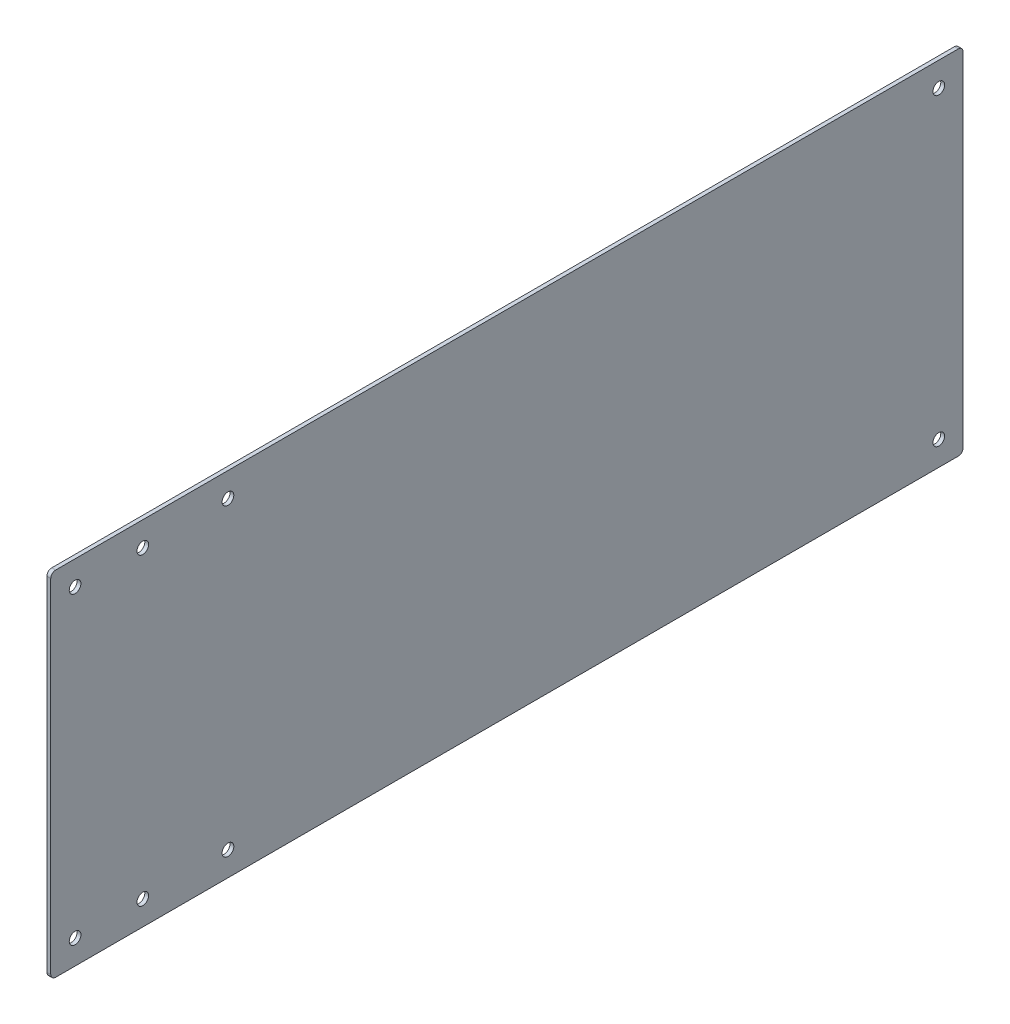
ISO-10303-21;
HEADER;
FILE_DESCRIPTION(('STEP AP214'),'2;1');
FILE_NAME('part.step','',(''),(''),'','','');
FILE_SCHEMA(('AUTOMOTIVE_DESIGN { 1 0 10303 214 1 1 1 1 }'));
ENDSEC;
DATA;
#1=APPLICATION_CONTEXT('core data for automotive mechanical design processes');
#2=APPLICATION_PROTOCOL_DEFINITION('international standard','automotive_design',2000,#1);
#3=PRODUCT_CONTEXT('',#1,'mechanical');
#4=PRODUCT('Part','Part','',(#3));
#5=PRODUCT_RELATED_PRODUCT_CATEGORY('part','',(#4));
#6=PRODUCT_DEFINITION_FORMATION('','',#4);
#7=PRODUCT_DEFINITION_CONTEXT('part definition',#1,'design');
#8=PRODUCT_DEFINITION('design','',#6,#7);
#9=PRODUCT_DEFINITION_SHAPE('','',#8);
#10=(LENGTH_UNIT() NAMED_UNIT(*) SI_UNIT(.MILLI.,.METRE.));
#11=(NAMED_UNIT(*) PLANE_ANGLE_UNIT() SI_UNIT($,.RADIAN.));
#12=(NAMED_UNIT(*) SI_UNIT($,.STERADIAN.) SOLID_ANGLE_UNIT());
#13=UNCERTAINTY_MEASURE_WITH_UNIT(LENGTH_MEASURE(1.E-05),#10,'distance_accuracy_value','');
#14=(GEOMETRIC_REPRESENTATION_CONTEXT(3) GLOBAL_UNCERTAINTY_ASSIGNED_CONTEXT((#13)) GLOBAL_UNIT_ASSIGNED_CONTEXT((#10,
#11,#12)) REPRESENTATION_CONTEXT('',''));
#15=CARTESIAN_POINT('',(0.,0.,0.));
#16=DIRECTION('',(0.,0.,1.));
#17=DIRECTION('',(1.,0.,0.));
#18=AXIS2_PLACEMENT_3D('',#15,#16,#17);
#19=CARTESIAN_POINT('',(-1.5875,-72.49,-187.5));
#20=DIRECTION('',(0.,0.,-1.));
#21=DIRECTION('',(-1.,0.,0.));
#22=AXIS2_PLACEMENT_3D('',#19,#20,#21);
#23=PLANE('',#22);
#24=DIRECTION('',(0.,1.,0.));
#25=VECTOR('',#24,1.);
#26=CARTESIAN_POINT('',(0.,-72.49,-187.5));
#27=LINE('',#26,#25);
#28=CARTESIAN_POINT('',(0.,-70.49,-187.5));
#29=VERTEX_POINT('',#28);
#30=CARTESIAN_POINT('',(0.,70.49,-187.5));
#31=VERTEX_POINT('',#30);
#32=EDGE_CURVE('E113',#29,#31,#27,.T.);
#33=ORIENTED_EDGE('',*,*,#32,.F.);
#34=DIRECTION('',(1.,0.,0.));
#35=VECTOR('',#34,1.);
#36=CARTESIAN_POINT('',(-1.5875,-70.49,-187.5));
#37=LINE('',#36,#35);
#38=CARTESIAN_POINT('',(-1.5875,-70.49,-187.5));
#39=VERTEX_POINT('',#38);
#40=EDGE_CURVE('E48',#29,#39,#37,.F.);
#41=ORIENTED_EDGE('',*,*,#40,.T.);
#42=DIRECTION('',(0.,1.,0.));
#43=VECTOR('',#42,1.);
#44=CARTESIAN_POINT('',(-1.5875,-72.49,-187.5));
#45=LINE('',#44,#43);
#46=CARTESIAN_POINT('',(-1.5875,70.49,-187.5));
#47=VERTEX_POINT('',#46);
#48=EDGE_CURVE('E170',#39,#47,#45,.T.);
#49=ORIENTED_EDGE('',*,*,#48,.T.);
#50=DIRECTION('',(1.,0.,0.));
#51=VECTOR('',#50,1.);
#52=CARTESIAN_POINT('',(-1.5875,70.49,-187.5));
#53=LINE('',#52,#51);
#54=EDGE_CURVE('E149',#47,#31,#53,.T.);
#55=ORIENTED_EDGE('',*,*,#54,.T.);
#56=EDGE_LOOP('',(#33,#41,#49,#55));
#57=FACE_BOUND('',#56,.T.);
#58=ADVANCED_FACE('F40',(#57),#23,.T.);
#59=CARTESIAN_POINT('',(-1.5875,-72.49,187.5));
#60=DIRECTION('',(0.,-1.,0.));
#61=DIRECTION('',(0.,0.,-1.));
#62=AXIS2_PLACEMENT_3D('',#59,#60,#61);
#63=PLANE('',#62);
#64=DIRECTION('',(0.,0.,-1.));
#65=VECTOR('',#64,1.);
#66=CARTESIAN_POINT('',(-1.5875,-72.49,187.5));
#67=LINE('',#66,#65);
#68=CARTESIAN_POINT('',(-1.5875,-72.49,185.5));
#69=VERTEX_POINT('',#68);
#70=CARTESIAN_POINT('',(-1.5875,-72.49,-185.5));
#71=VERTEX_POINT('',#70);
#72=EDGE_CURVE('E127',#69,#71,#67,.T.);
#73=ORIENTED_EDGE('',*,*,#72,.T.);
#74=DIRECTION('',(1.,0.,0.));
#75=VECTOR('',#74,1.);
#76=CARTESIAN_POINT('',(-1.5875,-72.49,-185.5));
#77=LINE('',#76,#75);
#78=CARTESIAN_POINT('',(0.,-72.49,-185.5));
#79=VERTEX_POINT('',#78);
#80=EDGE_CURVE('E158',#71,#79,#77,.T.);
#81=ORIENTED_EDGE('',*,*,#80,.T.);
#82=DIRECTION('',(0.,0.,-1.));
#83=VECTOR('',#82,1.);
#84=CARTESIAN_POINT('',(0.,-72.49,187.5));
#85=LINE('',#84,#83);
#86=CARTESIAN_POINT('',(0.,-72.49,185.5));
#87=VERTEX_POINT('',#86);
#88=EDGE_CURVE('E134',#87,#79,#85,.T.);
#89=ORIENTED_EDGE('',*,*,#88,.F.);
#90=DIRECTION('',(1.,0.,0.));
#91=VECTOR('',#90,1.);
#92=CARTESIAN_POINT('',(-1.5875,-72.49,185.5));
#93=LINE('',#92,#91);
#94=EDGE_CURVE('E145',#87,#69,#93,.F.);
#95=ORIENTED_EDGE('',*,*,#94,.T.);
#96=EDGE_LOOP('',(#73,#81,#89,#95));
#97=FACE_BOUND('',#96,.T.);
#98=ADVANCED_FACE('F164',(#97),#63,.T.);
#99=CARTESIAN_POINT('',(-1.5875,-72.49,187.5));
#100=DIRECTION('',(0.,0.,1.));
#101=DIRECTION('',(1.,0.,0.));
#102=AXIS2_PLACEMENT_3D('',#99,#100,#101);
#103=PLANE('',#102);
#104=DIRECTION('',(0.,-1.,0.));
#105=VECTOR('',#104,1.);
#106=CARTESIAN_POINT('',(-1.5875,-72.49,187.5));
#107=LINE('',#106,#105);
#108=CARTESIAN_POINT('',(-1.5875,70.49,187.5));
#109=VERTEX_POINT('',#108);
#110=CARTESIAN_POINT('',(-1.5875,-70.49,187.5));
#111=VERTEX_POINT('',#110);
#112=EDGE_CURVE('E131',#109,#111,#107,.T.);
#113=ORIENTED_EDGE('',*,*,#112,.T.);
#114=DIRECTION('',(1.,0.,0.));
#115=VECTOR('',#114,1.);
#116=CARTESIAN_POINT('',(-1.5875,-70.49,187.5));
#117=LINE('',#116,#115);
#118=CARTESIAN_POINT('',(0.,-70.49,187.5));
#119=VERTEX_POINT('',#118);
#120=EDGE_CURVE('E140',#111,#119,#117,.T.);
#121=ORIENTED_EDGE('',*,*,#120,.T.);
#122=DIRECTION('',(0.,-1.,0.));
#123=VECTOR('',#122,1.);
#124=CARTESIAN_POINT('',(0.,-72.49,187.5));
#125=LINE('',#124,#123);
#126=CARTESIAN_POINT('',(0.,70.49,187.5));
#127=VERTEX_POINT('',#126);
#128=EDGE_CURVE('E112',#127,#119,#125,.T.);
#129=ORIENTED_EDGE('',*,*,#128,.F.);
#130=DIRECTION('',(1.,0.,0.));
#131=VECTOR('',#130,1.);
#132=CARTESIAN_POINT('',(-1.5875,70.49,187.5));
#133=LINE('',#132,#131);
#134=EDGE_CURVE('E121',#127,#109,#133,.F.);
#135=ORIENTED_EDGE('',*,*,#134,.T.);
#136=EDGE_LOOP('',(#113,#121,#129,#135));
#137=FACE_BOUND('',#136,.T.);
#138=ADVANCED_FACE('F271',(#137),#103,.T.);
#139=CARTESIAN_POINT('',(-1.5875,72.49,187.5));
#140=DIRECTION('',(0.,1.,0.));
#141=DIRECTION('',(0.,0.,1.));
#142=AXIS2_PLACEMENT_3D('',#139,#140,#141);
#143=PLANE('',#142);
#144=DIRECTION('',(0.,0.,1.));
#145=VECTOR('',#144,1.);
#146=CARTESIAN_POINT('',(0.,72.49,187.5));
#147=LINE('',#146,#145);
#148=CARTESIAN_POINT('',(0.,72.49,-185.5));
#149=VERTEX_POINT('',#148);
#150=CARTESIAN_POINT('',(0.,72.49,185.5));
#151=VERTEX_POINT('',#150);
#152=EDGE_CURVE('E101',#149,#151,#147,.T.);
#153=ORIENTED_EDGE('',*,*,#152,.F.);
#154=DIRECTION('',(1.,0.,0.));
#155=VECTOR('',#154,1.);
#156=CARTESIAN_POINT('',(-1.5875,72.49,-185.5));
#157=LINE('',#156,#155);
#158=CARTESIAN_POINT('',(-1.5875,72.49,-185.5));
#159=VERTEX_POINT('',#158);
#160=EDGE_CURVE('E153',#149,#159,#157,.F.);
#161=ORIENTED_EDGE('',*,*,#160,.T.);
#162=DIRECTION('',(0.,0.,1.));
#163=VECTOR('',#162,1.);
#164=CARTESIAN_POINT('',(-1.5875,72.49,187.5));
#165=LINE('',#164,#163);
#166=CARTESIAN_POINT('',(-1.5875,72.49,185.5));
#167=VERTEX_POINT('',#166);
#168=EDGE_CURVE('E125',#159,#167,#165,.T.);
#169=ORIENTED_EDGE('',*,*,#168,.T.);
#170=DIRECTION('',(1.,0.,0.));
#171=VECTOR('',#170,1.);
#172=CARTESIAN_POINT('',(-1.5875,72.49,185.5));
#173=LINE('',#172,#171);
#174=EDGE_CURVE('E120',#167,#151,#173,.T.);
#175=ORIENTED_EDGE('',*,*,#174,.T.);
#176=EDGE_LOOP('',(#153,#161,#169,#175));
#177=FACE_BOUND('',#176,.T.);
#178=ADVANCED_FACE('F123',(#177),#143,.T.);
#179=CARTESIAN_POINT('',(-1.5875,0.,0.));
#180=DIRECTION('',(-1.,0.,0.));
#181=DIRECTION('',(0.,0.,1.));
#182=AXIS2_PLACEMENT_3D('',#179,#180,#181);
#183=PLANE('',#182);
#184=CARTESIAN_POINT('',(-1.5875,-62.49,149.66));
#185=DIRECTION('',(1.,0.,0.));
#186=DIRECTION('',(0.,0.,-1.));
#187=AXIS2_PLACEMENT_3D('',#184,#185,#186);
#188=CIRCLE('',#187,2.4);
#189=CARTESIAN_POINT('',(-1.5875,-62.49,147.26));
#190=VERTEX_POINT('',#189);
#191=EDGE_CURVE('E219',#190,#190,#188,.T.);
#192=ORIENTED_EDGE('',*,*,#191,.T.);
#193=EDGE_LOOP('',(#192));
#194=FACE_BOUND('',#193,.T.);
#195=CARTESIAN_POINT('',(-1.5875,-62.49,114.66));
#196=DIRECTION('',(1.,0.,0.));
#197=DIRECTION('',(0.,0.,-1.));
#198=AXIS2_PLACEMENT_3D('',#195,#196,#197);
#199=CIRCLE('',#198,2.4);
#200=CARTESIAN_POINT('',(-1.5875,-62.49,112.26));
#201=VERTEX_POINT('',#200);
#202=EDGE_CURVE('E213',#201,#201,#199,.T.);
#203=ORIENTED_EDGE('',*,*,#202,.T.);
#204=EDGE_LOOP('',(#203));
#205=FACE_BOUND('',#204,.T.);
#206=CARTESIAN_POINT('',(-1.5875,62.49,149.66));
#207=DIRECTION('',(1.,0.,0.));
#208=DIRECTION('',(0.,0.,-1.));
#209=AXIS2_PLACEMENT_3D('',#206,#207,#208);
#210=CIRCLE('',#209,2.40000000000001);
#211=CARTESIAN_POINT('',(-1.5875,62.49,147.26));
#212=VERTEX_POINT('',#211);
#213=EDGE_CURVE('E207',#212,#212,#210,.T.);
#214=ORIENTED_EDGE('',*,*,#213,.T.);
#215=EDGE_LOOP('',(#214));
#216=FACE_BOUND('',#215,.T.);
#217=CARTESIAN_POINT('',(-1.5875,62.49,114.66));
#218=DIRECTION('',(1.,0.,0.));
#219=DIRECTION('',(0.,0.,-1.));
#220=AXIS2_PLACEMENT_3D('',#217,#218,#219);
#221=CIRCLE('',#220,2.40000000000001);
#222=CARTESIAN_POINT('',(-1.5875,62.49,112.26));
#223=VERTEX_POINT('',#222);
#224=EDGE_CURVE('E201',#223,#223,#221,.T.);
#225=ORIENTED_EDGE('',*,*,#224,.T.);
#226=EDGE_LOOP('',(#225));
#227=FACE_BOUND('',#226,.T.);
#228=CARTESIAN_POINT('',(-1.5875,-62.49,177.5));
#229=DIRECTION('',(-1.,0.,0.));
#230=DIRECTION('',(0.,0.,1.));
#231=AXIS2_PLACEMENT_3D('',#228,#229,#230);
#232=CIRCLE('',#231,2.4);
#233=CARTESIAN_POINT('',(-1.5875,-62.49,179.9));
#234=VERTEX_POINT('',#233);
#235=EDGE_CURVE('E198',#234,#234,#232,.T.);
#236=ORIENTED_EDGE('',*,*,#235,.F.);
#237=EDGE_LOOP('',(#236));
#238=FACE_BOUND('',#237,.T.);
#239=CARTESIAN_POINT('',(-1.5875,-62.49,-177.5));
#240=DIRECTION('',(-1.,0.,0.));
#241=DIRECTION('',(0.,0.,1.));
#242=AXIS2_PLACEMENT_3D('',#239,#240,#241);
#243=CIRCLE('',#242,2.4);
#244=CARTESIAN_POINT('',(-1.5875,-62.49,-175.1));
#245=VERTEX_POINT('',#244);
#246=EDGE_CURVE('E192',#245,#245,#243,.T.);
#247=ORIENTED_EDGE('',*,*,#246,.F.);
#248=EDGE_LOOP('',(#247));
#249=FACE_BOUND('',#248,.T.);
#250=CARTESIAN_POINT('',(-1.5875,62.49,-177.5));
#251=DIRECTION('',(-1.,0.,0.));
#252=DIRECTION('',(0.,0.,1.));
#253=AXIS2_PLACEMENT_3D('',#250,#251,#252);
#254=CIRCLE('',#253,2.40000000000001);
#255=CARTESIAN_POINT('',(-1.5875,62.49,-175.1));
#256=VERTEX_POINT('',#255);
#257=EDGE_CURVE('E186',#256,#256,#254,.T.);
#258=ORIENTED_EDGE('',*,*,#257,.F.);
#259=EDGE_LOOP('',(#258));
#260=FACE_BOUND('',#259,.T.);
#261=CARTESIAN_POINT('',(-1.5875,62.49,177.5));
#262=DIRECTION('',(-1.,0.,0.));
#263=DIRECTION('',(0.,0.,1.));
#264=AXIS2_PLACEMENT_3D('',#261,#262,#263);
#265=CIRCLE('',#264,2.40000000000001);
#266=CARTESIAN_POINT('',(-1.5875,62.49,179.9));
#267=VERTEX_POINT('',#266);
#268=EDGE_CURVE('E180',#267,#267,#265,.T.);
#269=ORIENTED_EDGE('',*,*,#268,.F.);
#270=EDGE_LOOP('',(#269));
#271=FACE_BOUND('',#270,.T.);
#272=ORIENTED_EDGE('',*,*,#48,.F.);
#273=CARTESIAN_POINT('',(-1.5875,-70.49,-185.5));
#274=DIRECTION('',(-1.,0.,0.));
#275=DIRECTION('',(0.,0.,1.));
#276=AXIS2_PLACEMENT_3D('',#273,#274,#275);
#277=CIRCLE('',#276,2.);
#278=EDGE_CURVE('E11',#39,#71,#277,.T.);
#279=ORIENTED_EDGE('',*,*,#278,.T.);
#280=ORIENTED_EDGE('',*,*,#72,.F.);
#281=CARTESIAN_POINT('',(-1.5875,-70.49,185.5));
#282=DIRECTION('',(-1.,0.,0.));
#283=DIRECTION('',(0.,0.,1.));
#284=AXIS2_PLACEMENT_3D('',#281,#282,#283);
#285=CIRCLE('',#284,2.);
#286=EDGE_CURVE('E147',#69,#111,#285,.T.);
#287=ORIENTED_EDGE('',*,*,#286,.T.);
#288=ORIENTED_EDGE('',*,*,#112,.F.);
#289=CARTESIAN_POINT('',(-1.5875,70.49,185.5));
#290=DIRECTION('',(-1.,0.,0.));
#291=DIRECTION('',(0.,0.,1.));
#292=AXIS2_PLACEMENT_3D('',#289,#290,#291);
#293=CIRCLE('',#292,2.);
#294=EDGE_CURVE('E138',#109,#167,#293,.T.);
#295=ORIENTED_EDGE('',*,*,#294,.T.);
#296=ORIENTED_EDGE('',*,*,#168,.F.);
#297=CARTESIAN_POINT('',(-1.5875,70.49,-185.5));
#298=DIRECTION('',(-1.,0.,0.));
#299=DIRECTION('',(0.,0.,1.));
#300=AXIS2_PLACEMENT_3D('',#297,#298,#299);
#301=CIRCLE('',#300,2.);
#302=EDGE_CURVE('E155',#159,#47,#301,.T.);
#303=ORIENTED_EDGE('',*,*,#302,.T.);
#304=EDGE_LOOP('',(#272,#279,#280,#287,#288,#295,#296,#303));
#305=FACE_BOUND('',#304,.T.);
#306=ADVANCED_FACE('F231',(#194,#205,#216,#227,#238,#249,#260,#271,#305),#183,.T.);
#307=CARTESIAN_POINT('',(0.,0.,0.));
#308=DIRECTION('',(-1.,0.,0.));
#309=DIRECTION('',(0.,0.,1.));
#310=AXIS2_PLACEMENT_3D('',#307,#308,#309);
#311=PLANE('',#310);
#312=CARTESIAN_POINT('',(0.,-62.49,149.66));
#313=DIRECTION('',(1.,0.,0.));
#314=DIRECTION('',(0.,0.,-1.));
#315=AXIS2_PLACEMENT_3D('',#312,#313,#314);
#316=CIRCLE('',#315,2.4);
#317=CARTESIAN_POINT('',(0.,-62.49,147.26));
#318=VERTEX_POINT('',#317);
#319=EDGE_CURVE('E222',#318,#318,#316,.T.);
#320=ORIENTED_EDGE('',*,*,#319,.F.);
#321=EDGE_LOOP('',(#320));
#322=FACE_BOUND('',#321,.T.);
#323=CARTESIAN_POINT('',(0.,-62.49,114.66));
#324=DIRECTION('',(1.,0.,0.));
#325=DIRECTION('',(0.,0.,-1.));
#326=AXIS2_PLACEMENT_3D('',#323,#324,#325);
#327=CIRCLE('',#326,2.4);
#328=CARTESIAN_POINT('',(0.,-62.49,112.26));
#329=VERTEX_POINT('',#328);
#330=EDGE_CURVE('E216',#329,#329,#327,.T.);
#331=ORIENTED_EDGE('',*,*,#330,.F.);
#332=EDGE_LOOP('',(#331));
#333=FACE_BOUND('',#332,.T.);
#334=CARTESIAN_POINT('',(0.,62.49,149.66));
#335=DIRECTION('',(1.,0.,0.));
#336=DIRECTION('',(0.,0.,-1.));
#337=AXIS2_PLACEMENT_3D('',#334,#335,#336);
#338=CIRCLE('',#337,2.40000000000001);
#339=CARTESIAN_POINT('',(0.,62.49,147.26));
#340=VERTEX_POINT('',#339);
#341=EDGE_CURVE('E210',#340,#340,#338,.T.);
#342=ORIENTED_EDGE('',*,*,#341,.F.);
#343=EDGE_LOOP('',(#342));
#344=FACE_BOUND('',#343,.T.);
#345=CARTESIAN_POINT('',(0.,62.49,114.66));
#346=DIRECTION('',(1.,0.,0.));
#347=DIRECTION('',(0.,0.,-1.));
#348=AXIS2_PLACEMENT_3D('',#345,#346,#347);
#349=CIRCLE('',#348,2.40000000000001);
#350=CARTESIAN_POINT('',(0.,62.49,112.26));
#351=VERTEX_POINT('',#350);
#352=EDGE_CURVE('E204',#351,#351,#349,.T.);
#353=ORIENTED_EDGE('',*,*,#352,.F.);
#354=EDGE_LOOP('',(#353));
#355=FACE_BOUND('',#354,.T.);
#356=CARTESIAN_POINT('',(0.,-62.49,177.5));
#357=DIRECTION('',(-1.,0.,0.));
#358=DIRECTION('',(0.,0.,1.));
#359=AXIS2_PLACEMENT_3D('',#356,#357,#358);
#360=CIRCLE('',#359,2.4);
#361=CARTESIAN_POINT('',(0.,-62.49,179.9));
#362=VERTEX_POINT('',#361);
#363=EDGE_CURVE('E195',#362,#362,#360,.T.);
#364=ORIENTED_EDGE('',*,*,#363,.T.);
#365=EDGE_LOOP('',(#364));
#366=FACE_BOUND('',#365,.T.);
#367=CARTESIAN_POINT('',(0.,-62.49,-177.5));
#368=DIRECTION('',(-1.,0.,0.));
#369=DIRECTION('',(0.,0.,1.));
#370=AXIS2_PLACEMENT_3D('',#367,#368,#369);
#371=CIRCLE('',#370,2.4);
#372=CARTESIAN_POINT('',(0.,-62.49,-175.1));
#373=VERTEX_POINT('',#372);
#374=EDGE_CURVE('E189',#373,#373,#371,.T.);
#375=ORIENTED_EDGE('',*,*,#374,.T.);
#376=EDGE_LOOP('',(#375));
#377=FACE_BOUND('',#376,.T.);
#378=CARTESIAN_POINT('',(0.,62.49,-177.5));
#379=DIRECTION('',(-1.,0.,0.));
#380=DIRECTION('',(0.,0.,1.));
#381=AXIS2_PLACEMENT_3D('',#378,#379,#380);
#382=CIRCLE('',#381,2.40000000000001);
#383=CARTESIAN_POINT('',(0.,62.49,-175.1));
#384=VERTEX_POINT('',#383);
#385=EDGE_CURVE('E183',#384,#384,#382,.T.);
#386=ORIENTED_EDGE('',*,*,#385,.T.);
#387=EDGE_LOOP('',(#386));
#388=FACE_BOUND('',#387,.T.);
#389=CARTESIAN_POINT('',(0.,62.49,177.5));
#390=DIRECTION('',(-1.,0.,0.));
#391=DIRECTION('',(0.,0.,1.));
#392=AXIS2_PLACEMENT_3D('',#389,#390,#391);
#393=CIRCLE('',#392,2.40000000000001);
#394=CARTESIAN_POINT('',(0.,62.49,179.9));
#395=VERTEX_POINT('',#394);
#396=EDGE_CURVE('E173',#395,#395,#393,.T.);
#397=ORIENTED_EDGE('',*,*,#396,.T.);
#398=EDGE_LOOP('',(#397));
#399=FACE_BOUND('',#398,.T.);
#400=ORIENTED_EDGE('',*,*,#88,.T.);
#401=CARTESIAN_POINT('',(0.,-70.49,-185.5));
#402=DIRECTION('',(-1.,0.,0.));
#403=DIRECTION('',(0.,0.,1.));
#404=AXIS2_PLACEMENT_3D('',#401,#402,#403);
#405=CIRCLE('',#404,2.);
#406=EDGE_CURVE('E62',#79,#29,#405,.F.);
#407=ORIENTED_EDGE('',*,*,#406,.T.);
#408=ORIENTED_EDGE('',*,*,#32,.T.);
#409=CARTESIAN_POINT('',(0.,70.49,-185.5));
#410=DIRECTION('',(-1.,0.,0.));
#411=DIRECTION('',(0.,0.,1.));
#412=AXIS2_PLACEMENT_3D('',#409,#410,#411);
#413=CIRCLE('',#412,2.);
#414=EDGE_CURVE('E108',#31,#149,#413,.F.);
#415=ORIENTED_EDGE('',*,*,#414,.T.);
#416=ORIENTED_EDGE('',*,*,#152,.T.);
#417=CARTESIAN_POINT('',(0.,70.49,185.5));
#418=DIRECTION('',(-1.,0.,0.));
#419=DIRECTION('',(0.,0.,1.));
#420=AXIS2_PLACEMENT_3D('',#417,#418,#419);
#421=CIRCLE('',#420,2.);
#422=EDGE_CURVE('E105',#151,#127,#421,.F.);
#423=ORIENTED_EDGE('',*,*,#422,.T.);
#424=ORIENTED_EDGE('',*,*,#128,.T.);
#425=CARTESIAN_POINT('',(0.,-70.49,185.5));
#426=DIRECTION('',(-1.,0.,0.));
#427=DIRECTION('',(0.,0.,1.));
#428=AXIS2_PLACEMENT_3D('',#425,#426,#427);
#429=CIRCLE('',#428,2.);
#430=EDGE_CURVE('E143',#119,#87,#429,.F.);
#431=ORIENTED_EDGE('',*,*,#430,.T.);
#432=EDGE_LOOP('',(#400,#407,#408,#415,#416,#423,#424,#431));
#433=FACE_BOUND('',#432,.T.);
#434=ADVANCED_FACE('F103',(#322,#333,#344,#355,#366,#377,#388,#399,#433),#311,.F.);
#435=CARTESIAN_POINT('',(-1.5875,62.49,177.5));
#436=DIRECTION('',(-1.,0.,0.));
#437=DIRECTION('',(0.,0.,1.));
#438=AXIS2_PLACEMENT_3D('',#435,#436,#437);
#439=CYLINDRICAL_SURFACE('',#438,2.40000000000001);
#440=ORIENTED_EDGE('',*,*,#396,.F.);
#441=EDGE_LOOP('',(#440));
#442=FACE_BOUND('',#441,.T.);
#443=ORIENTED_EDGE('',*,*,#268,.T.);
#444=EDGE_LOOP('',(#443));
#445=FACE_BOUND('',#444,.T.);
#446=ADVANCED_FACE('F230',(#442,#445),#439,.F.);
#447=CARTESIAN_POINT('',(-1.5875,62.49,-177.5));
#448=DIRECTION('',(-1.,0.,0.));
#449=DIRECTION('',(0.,0.,1.));
#450=AXIS2_PLACEMENT_3D('',#447,#448,#449);
#451=CYLINDRICAL_SURFACE('',#450,2.40000000000001);
#452=ORIENTED_EDGE('',*,*,#385,.F.);
#453=EDGE_LOOP('',(#452));
#454=FACE_BOUND('',#453,.T.);
#455=ORIENTED_EDGE('',*,*,#257,.T.);
#456=EDGE_LOOP('',(#455));
#457=FACE_BOUND('',#456,.T.);
#458=ADVANCED_FACE('F249',(#454,#457),#451,.F.);
#459=CARTESIAN_POINT('',(-1.5875,-62.49,-177.5));
#460=DIRECTION('',(-1.,0.,0.));
#461=DIRECTION('',(0.,0.,1.));
#462=AXIS2_PLACEMENT_3D('',#459,#460,#461);
#463=CYLINDRICAL_SURFACE('',#462,2.4);
#464=ORIENTED_EDGE('',*,*,#374,.F.);
#465=EDGE_LOOP('',(#464));
#466=FACE_BOUND('',#465,.T.);
#467=ORIENTED_EDGE('',*,*,#246,.T.);
#468=EDGE_LOOP('',(#467));
#469=FACE_BOUND('',#468,.T.);
#470=ADVANCED_FACE('F293',(#466,#469),#463,.F.);
#471=CARTESIAN_POINT('',(-1.5875,-62.49,177.5));
#472=DIRECTION('',(-1.,0.,0.));
#473=DIRECTION('',(0.,0.,1.));
#474=AXIS2_PLACEMENT_3D('',#471,#472,#473);
#475=CYLINDRICAL_SURFACE('',#474,2.4);
#476=ORIENTED_EDGE('',*,*,#363,.F.);
#477=EDGE_LOOP('',(#476));
#478=FACE_BOUND('',#477,.T.);
#479=ORIENTED_EDGE('',*,*,#235,.T.);
#480=EDGE_LOOP('',(#479));
#481=FACE_BOUND('',#480,.T.);
#482=ADVANCED_FACE('F297',(#478,#481),#475,.F.);
#483=CARTESIAN_POINT('',(0.,62.49,114.66));
#484=DIRECTION('',(1.,0.,0.));
#485=DIRECTION('',(0.,0.,-1.));
#486=AXIS2_PLACEMENT_3D('',#483,#484,#485);
#487=CYLINDRICAL_SURFACE('',#486,2.40000000000001);
#488=ORIENTED_EDGE('',*,*,#224,.F.);
#489=EDGE_LOOP('',(#488));
#490=FACE_BOUND('',#489,.T.);
#491=ORIENTED_EDGE('',*,*,#352,.T.);
#492=EDGE_LOOP('',(#491));
#493=FACE_BOUND('',#492,.T.);
#494=ADVANCED_FACE('F301',(#490,#493),#487,.F.);
#495=CARTESIAN_POINT('',(0.,62.49,149.66));
#496=DIRECTION('',(1.,0.,0.));
#497=DIRECTION('',(0.,0.,-1.));
#498=AXIS2_PLACEMENT_3D('',#495,#496,#497);
#499=CYLINDRICAL_SURFACE('',#498,2.40000000000001);
#500=ORIENTED_EDGE('',*,*,#213,.F.);
#501=EDGE_LOOP('',(#500));
#502=FACE_BOUND('',#501,.T.);
#503=ORIENTED_EDGE('',*,*,#341,.T.);
#504=EDGE_LOOP('',(#503));
#505=FACE_BOUND('',#504,.T.);
#506=ADVANCED_FACE('F305',(#502,#505),#499,.F.);
#507=CARTESIAN_POINT('',(0.,-62.49,114.66));
#508=DIRECTION('',(1.,0.,0.));
#509=DIRECTION('',(0.,0.,-1.));
#510=AXIS2_PLACEMENT_3D('',#507,#508,#509);
#511=CYLINDRICAL_SURFACE('',#510,2.4);
#512=ORIENTED_EDGE('',*,*,#202,.F.);
#513=EDGE_LOOP('',(#512));
#514=FACE_BOUND('',#513,.T.);
#515=ORIENTED_EDGE('',*,*,#330,.T.);
#516=EDGE_LOOP('',(#515));
#517=FACE_BOUND('',#516,.T.);
#518=ADVANCED_FACE('F309',(#514,#517),#511,.F.);
#519=CARTESIAN_POINT('',(0.,-62.49,149.66));
#520=DIRECTION('',(1.,0.,0.));
#521=DIRECTION('',(0.,0.,-1.));
#522=AXIS2_PLACEMENT_3D('',#519,#520,#521);
#523=CYLINDRICAL_SURFACE('',#522,2.4);
#524=ORIENTED_EDGE('',*,*,#191,.F.);
#525=EDGE_LOOP('',(#524));
#526=FACE_BOUND('',#525,.T.);
#527=ORIENTED_EDGE('',*,*,#319,.T.);
#528=EDGE_LOOP('',(#527));
#529=FACE_BOUND('',#528,.T.);
#530=ADVANCED_FACE('F226',(#526,#529),#523,.F.);
#531=CARTESIAN_POINT('',(-1.5875,70.49,185.5));
#532=DIRECTION('',(1.,0.,0.));
#533=DIRECTION('',(0.,0.,-1.));
#534=AXIS2_PLACEMENT_3D('',#531,#532,#533);
#535=CYLINDRICAL_SURFACE('',#534,2.);
#536=ORIENTED_EDGE('',*,*,#294,.F.);
#537=ORIENTED_EDGE('',*,*,#134,.F.);
#538=ORIENTED_EDGE('',*,*,#422,.F.);
#539=ORIENTED_EDGE('',*,*,#174,.F.);
#540=EDGE_LOOP('',(#536,#537,#538,#539));
#541=FACE_BOUND('',#540,.T.);
#542=ADVANCED_FACE('F119',(#541),#535,.T.);
#543=CARTESIAN_POINT('',(-1.5875,-70.49,185.5));
#544=DIRECTION('',(1.,0.,0.));
#545=DIRECTION('',(0.,0.,-1.));
#546=AXIS2_PLACEMENT_3D('',#543,#544,#545);
#547=CYLINDRICAL_SURFACE('',#546,2.);
#548=ORIENTED_EDGE('',*,*,#286,.F.);
#549=ORIENTED_EDGE('',*,*,#94,.F.);
#550=ORIENTED_EDGE('',*,*,#430,.F.);
#551=ORIENTED_EDGE('',*,*,#120,.F.);
#552=EDGE_LOOP('',(#548,#549,#550,#551));
#553=FACE_BOUND('',#552,.T.);
#554=ADVANCED_FACE('F264',(#553),#547,.T.);
#555=CARTESIAN_POINT('',(-1.5875,70.49,-185.5));
#556=DIRECTION('',(1.,0.,0.));
#557=DIRECTION('',(0.,0.,-1.));
#558=AXIS2_PLACEMENT_3D('',#555,#556,#557);
#559=CYLINDRICAL_SURFACE('',#558,2.);
#560=ORIENTED_EDGE('',*,*,#302,.F.);
#561=ORIENTED_EDGE('',*,*,#160,.F.);
#562=ORIENTED_EDGE('',*,*,#414,.F.);
#563=ORIENTED_EDGE('',*,*,#54,.F.);
#564=EDGE_LOOP('',(#560,#561,#562,#563));
#565=FACE_BOUND('',#564,.T.);
#566=ADVANCED_FACE('F260',(#565),#559,.T.);
#567=CARTESIAN_POINT('',(-1.5875,-70.49,-185.5));
#568=DIRECTION('',(1.,0.,0.));
#569=DIRECTION('',(0.,0.,-1.));
#570=AXIS2_PLACEMENT_3D('',#567,#568,#569);
#571=CYLINDRICAL_SURFACE('',#570,2.);
#572=ORIENTED_EDGE('',*,*,#278,.F.);
#573=ORIENTED_EDGE('',*,*,#40,.F.);
#574=ORIENTED_EDGE('',*,*,#406,.F.);
#575=ORIENTED_EDGE('',*,*,#80,.F.);
#576=EDGE_LOOP('',(#572,#573,#574,#575));
#577=FACE_BOUND('',#576,.T.);
#578=ADVANCED_FACE('F42',(#577),#571,.T.);
#579=CLOSED_SHELL('',(#58,#98,#138,#178,#306,#434,#446,#458,#470,#482,#494,#506,#518,#530,#542,
#554,#566,#578));
#580=MANIFOLD_SOLID_BREP('B2',#579);
#581=ADVANCED_BREP_SHAPE_REPRESENTATION('',(#18,#580),#14);
#582=SHAPE_DEFINITION_REPRESENTATION(#9,#581);
ENDSEC;
END-ISO-10303-21;
